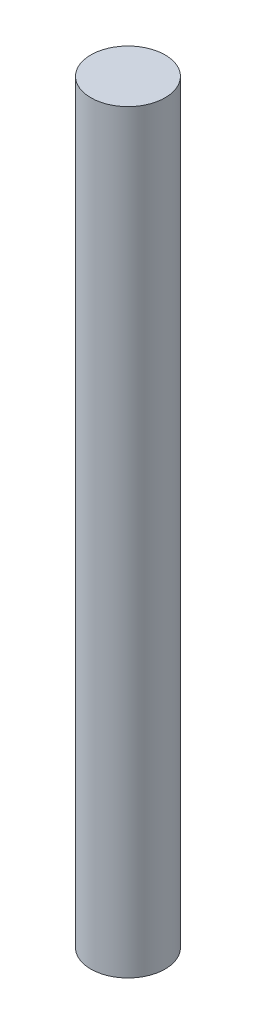
ISO-10303-21;
HEADER;
FILE_DESCRIPTION(('STEP AP214'),'2;1');
FILE_NAME('part.step','',(''),(''),'','','');
FILE_SCHEMA(('AUTOMOTIVE_DESIGN { 1 0 10303 214 1 1 1 1 }'));
ENDSEC;
DATA;
#1=APPLICATION_CONTEXT('core data for automotive mechanical design processes');
#2=APPLICATION_PROTOCOL_DEFINITION('international standard','automotive_design',2000,#1);
#3=PRODUCT_CONTEXT('',#1,'mechanical');
#4=PRODUCT('Part','Part','',(#3));
#5=PRODUCT_RELATED_PRODUCT_CATEGORY('part','',(#4));
#6=PRODUCT_DEFINITION_FORMATION('','',#4);
#7=PRODUCT_DEFINITION_CONTEXT('part definition',#1,'design');
#8=PRODUCT_DEFINITION('design','',#6,#7);
#9=PRODUCT_DEFINITION_SHAPE('','',#8);
#10=(LENGTH_UNIT() NAMED_UNIT(*) SI_UNIT(.MILLI.,.METRE.));
#11=(NAMED_UNIT(*) PLANE_ANGLE_UNIT() SI_UNIT($,.RADIAN.));
#12=(NAMED_UNIT(*) SI_UNIT($,.STERADIAN.) SOLID_ANGLE_UNIT());
#13=UNCERTAINTY_MEASURE_WITH_UNIT(LENGTH_MEASURE(1.E-05),#10,'distance_accuracy_value','');
#14=(GEOMETRIC_REPRESENTATION_CONTEXT(3) GLOBAL_UNCERTAINTY_ASSIGNED_CONTEXT((#13)) GLOBAL_UNIT_ASSIGNED_CONTEXT((#10,
#11,#12)) REPRESENTATION_CONTEXT('',''));
#15=CARTESIAN_POINT('',(0.,0.,0.));
#16=DIRECTION('',(0.,0.,1.));
#17=DIRECTION('',(1.,0.,0.));
#18=AXIS2_PLACEMENT_3D('',#15,#16,#17);
#19=CARTESIAN_POINT('',(0.,25.4,0.));
#20=DIRECTION('',(0.,-1.,0.));
#21=DIRECTION('',(0.,0.,-1.));
#22=AXIS2_PLACEMENT_3D('',#19,#20,#21);
#23=CYLINDRICAL_SURFACE('',#22,1.25);
#24=CARTESIAN_POINT('',(0.,25.4,0.));
#25=DIRECTION('',(0.,1.,0.));
#26=DIRECTION('',(0.,0.,1.));
#27=AXIS2_PLACEMENT_3D('',#24,#25,#26);
#28=CIRCLE('',#27,1.25);
#29=CARTESIAN_POINT('',(0.,25.4,1.25));
#30=VERTEX_POINT('',#29);
#31=EDGE_CURVE('E10',#30,#30,#28,.T.);
#32=ORIENTED_EDGE('',*,*,#31,.F.);
#33=EDGE_LOOP('',(#32));
#34=FACE_BOUND('',#33,.T.);
#35=CARTESIAN_POINT('',(0.,0.,0.));
#36=DIRECTION('',(0.,1.,0.));
#37=DIRECTION('',(0.,0.,1.));
#38=AXIS2_PLACEMENT_3D('',#35,#36,#37);
#39=CIRCLE('',#38,1.25);
#40=CARTESIAN_POINT('',(0.,0.,1.25));
#41=VERTEX_POINT('',#40);
#42=EDGE_CURVE('E37',#41,#41,#39,.T.);
#43=ORIENTED_EDGE('',*,*,#42,.T.);
#44=EDGE_LOOP('',(#43));
#45=FACE_BOUND('',#44,.T.);
#46=ADVANCED_FACE('F34',(#34,#45),#23,.T.);
#47=CARTESIAN_POINT('',(0.,25.4,0.));
#48=DIRECTION('',(0.,1.,0.));
#49=DIRECTION('',(0.,0.,1.));
#50=AXIS2_PLACEMENT_3D('',#47,#48,#49);
#51=PLANE('',#50);
#52=ORIENTED_EDGE('',*,*,#31,.T.);
#53=EDGE_LOOP('',(#52));
#54=FACE_BOUND('',#53,.T.);
#55=ADVANCED_FACE('F49',(#54),#51,.T.);
#56=CARTESIAN_POINT('',(0.,0.,0.));
#57=DIRECTION('',(0.,1.,0.));
#58=DIRECTION('',(0.,0.,1.));
#59=AXIS2_PLACEMENT_3D('',#56,#57,#58);
#60=PLANE('',#59);
#61=ORIENTED_EDGE('',*,*,#42,.F.);
#62=EDGE_LOOP('',(#61));
#63=FACE_BOUND('',#62,.T.);
#64=ADVANCED_FACE('F47',(#63),#60,.F.);
#65=CLOSED_SHELL('',(#46,#55,#64));
#66=MANIFOLD_SOLID_BREP('B2',#65);
#67=ADVANCED_BREP_SHAPE_REPRESENTATION('',(#18,#66),#14);
#68=SHAPE_DEFINITION_REPRESENTATION(#9,#67);
ENDSEC;
END-ISO-10303-21;
